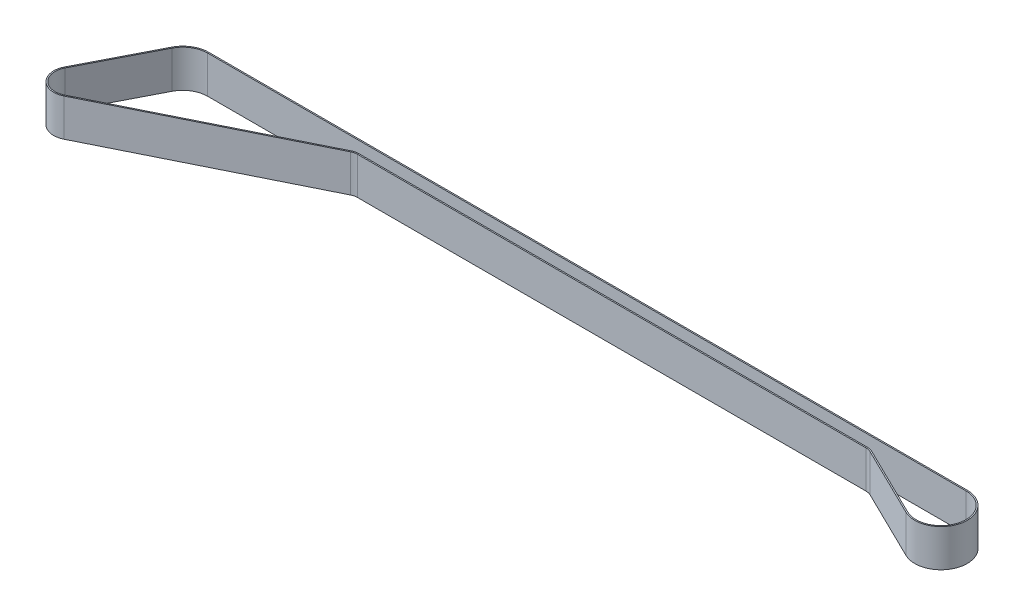
ISO-10303-21;
HEADER;
FILE_DESCRIPTION(('STEP AP214'),'2;1');
FILE_NAME('part.step','',(''),(''),'','','');
FILE_SCHEMA(('AUTOMOTIVE_DESIGN { 1 0 10303 214 1 1 1 1 }'));
ENDSEC;
DATA;
#1=APPLICATION_CONTEXT('core data for automotive mechanical design processes');
#2=APPLICATION_PROTOCOL_DEFINITION('international standard','automotive_design',2000,#1);
#3=PRODUCT_CONTEXT('',#1,'mechanical');
#4=PRODUCT('Part','Part','',(#3));
#5=PRODUCT_RELATED_PRODUCT_CATEGORY('part','',(#4));
#6=PRODUCT_DEFINITION_FORMATION('','',#4);
#7=PRODUCT_DEFINITION_CONTEXT('part definition',#1,'design');
#8=PRODUCT_DEFINITION('design','',#6,#7);
#9=PRODUCT_DEFINITION_SHAPE('','',#8);
#10=(LENGTH_UNIT() NAMED_UNIT(*) SI_UNIT(.MILLI.,.METRE.));
#11=(NAMED_UNIT(*) PLANE_ANGLE_UNIT() SI_UNIT($,.RADIAN.));
#12=(NAMED_UNIT(*) SI_UNIT($,.STERADIAN.) SOLID_ANGLE_UNIT());
#13=UNCERTAINTY_MEASURE_WITH_UNIT(LENGTH_MEASURE(1.E-05),#10,'distance_accuracy_value','');
#14=(GEOMETRIC_REPRESENTATION_CONTEXT(3) GLOBAL_UNCERTAINTY_ASSIGNED_CONTEXT((#13)) GLOBAL_UNIT_ASSIGNED_CONTEXT((#10,
#11,#12)) REPRESENTATION_CONTEXT('',''));
#15=CARTESIAN_POINT('',(0.,0.,0.));
#16=DIRECTION('',(0.,0.,1.));
#17=DIRECTION('',(1.,0.,0.));
#18=AXIS2_PLACEMENT_3D('',#15,#16,#17);
#19=CARTESIAN_POINT('',(-0.00171199897258548,15.,508.143236060332));
#20=DIRECTION('',(-3.36912675616625E-06,0.,0.999999999994325));
#21=DIRECTION('',(0.999999999994325,0.,3.36912675616625E-06));
#22=AXIS2_PLACEMENT_3D('',#19,#20,#21);
#23=PLANE('',#22);
#24=DIRECTION('',(-0.999999999994325,0.,-3.36912675616625E-06));
#25=VECTOR('',#24,1.);
#26=CARTESIAN_POINT('',(-0.00171199897258548,0.,508.143236060332));
#27=LINE('',#26,#25);
#28=CARTESIAN_POINT('',(1172.77740877326,0.,508.147187301847));
#29=VERTEX_POINT('',#28);
#30=CARTESIAN_POINT('',(868.796253252399,0.,508.146163150803));
#31=VERTEX_POINT('',#30);
#32=EDGE_CURVE('E239',#29,#31,#27,.T.);
#33=ORIENTED_EDGE('',*,*,#32,.T.);
#34=CARTESIAN_POINT('',(868.796253252399,15.,508.146163150817));
#35=DIRECTION('',(0.,-1.,0.));
#36=VECTOR('',#35,1.);
#37=LINE('',#34,#36);
#38=CARTESIAN_POINT('',(868.796253252399,15.,508.146163150803));
#39=VERTEX_POINT('',#38);
#40=EDGE_CURVE('E11',#39,#31,#37,.T.);
#41=ORIENTED_EDGE('',*,*,#40,.F.);
#42=DIRECTION('',(-0.999999999994325,0.,-3.36912675616625E-06));
#43=VECTOR('',#42,1.);
#44=CARTESIAN_POINT('',(-0.00171199897258548,15.,508.143236060332));
#45=LINE('',#44,#43);
#46=CARTESIAN_POINT('',(1172.77740877326,15.,508.147187301847));
#47=VERTEX_POINT('',#46);
#48=EDGE_CURVE('E397',#47,#39,#45,.T.);
#49=ORIENTED_EDGE('',*,*,#48,.F.);
#50=DIRECTION('',(0.,-1.,0.));
#51=VECTOR('',#50,1.);
#52=CARTESIAN_POINT('',(1172.77740877326,15.,508.147187301847));
#53=LINE('',#52,#51);
#54=EDGE_CURVE('E268',#47,#29,#53,.T.);
#55=ORIENTED_EDGE('',*,*,#54,.T.);
#56=EDGE_LOOP('',(#33,#41,#49,#55));
#57=FACE_BOUND('',#56,.T.);
#58=ADVANCED_FACE('F40',(#57),#23,.F.);
#59=CARTESIAN_POINT('',(868.796235564483,15.,518.646163150537));
#60=DIRECTION('',(0.,-1.,0.));
#61=DIRECTION('',(0.,0.,-1.));
#62=AXIS2_PLACEMENT_3D('',#59,#60,#61);
#63=CYLINDRICAL_SURFACE('',#62,10.4999999997344);
#64=CARTESIAN_POINT('',(868.796235564483,0.,518.646163150537));
#65=DIRECTION('',(0.,1.,0.));
#66=DIRECTION('',(0.,0.,1.));
#67=AXIS2_PLACEMENT_3D('',#64,#65,#66);
#68=CIRCLE('',#67,10.4999999997344);
#69=CARTESIAN_POINT('',(859.456696896738,0.,513.847932490375));
#70=VERTEX_POINT('',#69);
#71=EDGE_CURVE('E242',#31,#70,#68,.T.);
#72=ORIENTED_EDGE('',*,*,#71,.T.);
#73=DIRECTION('',(0.,-1.,0.));
#74=VECTOR('',#73,1.);
#75=CARTESIAN_POINT('',(859.456696896738,15.,513.847932490375));
#76=LINE('',#75,#74);
#77=CARTESIAN_POINT('',(859.456696896738,15.,513.847932490375));
#78=VERTEX_POINT('',#77);
#79=EDGE_CURVE('E52',#78,#70,#76,.T.);
#80=ORIENTED_EDGE('',*,*,#79,.F.);
#81=CARTESIAN_POINT('',(868.796235564483,15.,518.646163150537));
#82=DIRECTION('',(0.,1.,0.));
#83=DIRECTION('',(0.,0.,1.));
#84=AXIS2_PLACEMENT_3D('',#81,#82,#83);
#85=CIRCLE('',#84,10.4999999997344);
#86=EDGE_CURVE('E399',#39,#78,#85,.T.);
#87=ORIENTED_EDGE('',*,*,#86,.F.);
#88=ORIENTED_EDGE('',*,*,#40,.T.);
#89=EDGE_LOOP('',(#72,#80,#87,#88));
#90=FACE_BOUND('',#89,.T.);
#91=ADVANCED_FACE('F310',(#90),#63,.T.);
#92=CARTESIAN_POINT('',(888.843679737072,15.,456.647501330527));
#93=DIRECTION('',(-0.889479873141072,0.,-0.456974348598412));
#94=DIRECTION('',(-0.456974348598412,0.,0.889479873141072));
#95=AXIS2_PLACEMENT_3D('',#92,#93,#94);
#96=PLANE('',#95);
#97=DIRECTION('',(0.456974348598412,0.,-0.889479873141072));
#98=VECTOR('',#97,1.);
#99=CARTESIAN_POINT('',(888.843679737072,0.,456.647501330527));
#100=LINE('',#99,#98);
#101=CARTESIAN_POINT('',(844.881005563608,0.,542.218855536056));
#102=VERTEX_POINT('',#101);
#103=EDGE_CURVE('E247',#102,#70,#100,.T.);
#104=ORIENTED_EDGE('',*,*,#103,.F.);
#105=DIRECTION('',(0.,-1.,0.));
#106=VECTOR('',#105,1.);
#107=CARTESIAN_POINT('',(844.881005563608,15.,542.218855536056));
#108=LINE('',#107,#106);
#109=CARTESIAN_POINT('',(844.881005563608,15.,542.218855536056));
#110=VERTEX_POINT('',#109);
#111=EDGE_CURVE('E279',#110,#102,#108,.T.);
#112=ORIENTED_EDGE('',*,*,#111,.F.);
#113=DIRECTION('',(0.456974348598412,0.,-0.889479873141072));
#114=VECTOR('',#113,1.);
#115=CARTESIAN_POINT('',(888.843679737072,15.,456.647501330527));
#116=LINE('',#115,#114);
#117=EDGE_CURVE('E403',#110,#78,#116,.T.);
#118=ORIENTED_EDGE('',*,*,#117,.T.);
#119=ORIENTED_EDGE('',*,*,#79,.T.);
#120=EDGE_LOOP('',(#104,#112,#118,#119));
#121=FACE_BOUND('',#120,.T.);
#122=ADVANCED_FACE('F319',(#121),#96,.T.);
#123=CARTESIAN_POINT('',(851.552104612212,15.,545.646163150568));
#124=DIRECTION('',(0.,-1.,0.));
#125=DIRECTION('',(0.,0.,-1.));
#126=AXIS2_PLACEMENT_3D('',#123,#124,#125);
#127=CYLINDRICAL_SURFACE('',#126,7.50000000005222);
#128=CARTESIAN_POINT('',(851.552104612212,0.,545.646163150568));
#129=DIRECTION('',(0.,1.,0.));
#130=DIRECTION('',(0.,0.,1.));
#131=AXIS2_PLACEMENT_3D('',#128,#129,#130);
#132=CIRCLE('',#131,7.50000000005222);
#133=CARTESIAN_POINT('',(854.882744904987,0.,552.366046724033));
#134=VERTEX_POINT('',#133);
#135=EDGE_CURVE('E252',#102,#134,#132,.T.);
#136=ORIENTED_EDGE('',*,*,#135,.T.);
#137=DIRECTION('',(0.,-1.,0.));
#138=VECTOR('',#137,1.);
#139=CARTESIAN_POINT('',(854.882744904987,15.,552.366046724033));
#140=LINE('',#139,#138);
#141=CARTESIAN_POINT('',(854.882744904987,15.,552.366046724033));
#142=VERTEX_POINT('',#141);
#143=EDGE_CURVE('E276',#142,#134,#140,.T.);
#144=ORIENTED_EDGE('',*,*,#143,.F.);
#145=CARTESIAN_POINT('',(851.552104612212,15.,545.646163150568));
#146=DIRECTION('',(0.,1.,0.));
#147=DIRECTION('',(0.,0.,1.));
#148=AXIS2_PLACEMENT_3D('',#145,#146,#147);
#149=CIRCLE('',#148,7.50000000005222);
#150=EDGE_CURVE('E408',#110,#142,#149,.T.);
#151=ORIENTED_EDGE('',*,*,#150,.F.);
#152=ORIENTED_EDGE('',*,*,#111,.T.);
#153=EDGE_LOOP('',(#136,#144,#151,#152));
#154=FACE_BOUND('',#153,.T.);
#155=ADVANCED_FACE('F440',(#154),#127,.T.);
#156=CARTESIAN_POINT('',(388.375895029462,15.,783.585307305601));
#157=DIRECTION('',(-0.44408537236688,0.,-0.895984476455797));
#158=DIRECTION('',(-0.895984476455797,0.,0.44408537236688));
#159=AXIS2_PLACEMENT_3D('',#156,#157,#158);
#160=PLANE('',#159);
#161=DIRECTION('',(0.895984476455797,0.,-0.44408537236688));
#162=VECTOR('',#161,1.);
#163=CARTESIAN_POINT('',(388.375895029462,0.,783.585307305601));
#164=LINE('',#163,#162);
#165=CARTESIAN_POINT('',(931.727868646389,0.,514.278561630241));
#166=VERTEX_POINT('',#165);
#167=EDGE_CURVE('E254',#134,#166,#164,.T.);
#168=ORIENTED_EDGE('',*,*,#167,.T.);
#169=DIRECTION('',(0.,-1.,0.));
#170=VECTOR('',#169,1.);
#171=CARTESIAN_POINT('',(931.727868646389,15.,514.278561630241));
#172=LINE('',#171,#170);
#173=CARTESIAN_POINT('',(931.727868646389,15.,514.278561630241));
#174=VERTEX_POINT('',#173);
#175=EDGE_CURVE('E274',#174,#166,#172,.T.);
#176=ORIENTED_EDGE('',*,*,#175,.F.);
#177=DIRECTION('',(0.895984476455797,0.,-0.44408537236688));
#178=VECTOR('',#177,1.);
#179=CARTESIAN_POINT('',(388.375895029462,15.,783.585307305601));
#180=LINE('',#179,#178);
#181=EDGE_CURVE('E410',#142,#174,#180,.T.);
#182=ORIENTED_EDGE('',*,*,#181,.F.);
#183=ORIENTED_EDGE('',*,*,#143,.T.);
#184=EDGE_LOOP('',(#168,#176,#182,#183));
#185=FACE_BOUND('',#184,.T.);
#186=ADVANCED_FACE('F437',(#185),#160,.F.);
#187=CARTESIAN_POINT('',(933.948295508223,15.,518.75848401252));
#188=DIRECTION('',(0.,-1.,0.));
#189=DIRECTION('',(0.,0.,-1.));
#190=AXIS2_PLACEMENT_3D('',#187,#188,#189);
#191=CYLINDRICAL_SURFACE('',#190,5.00000000000018);
#192=CARTESIAN_POINT('',(933.948295508223,0.,518.75848401252));
#193=DIRECTION('',(0.,1.,0.));
#194=DIRECTION('',(0.,0.,1.));
#195=AXIS2_PLACEMENT_3D('',#192,#193,#194);
#196=CIRCLE('',#195,5.00000000000018);
#197=CARTESIAN_POINT('',(933.948295508223,0.,513.75848401252));
#198=VERTEX_POINT('',#197);
#199=EDGE_CURVE('E257',#198,#166,#196,.T.);
#200=ORIENTED_EDGE('',*,*,#199,.F.);
#201=DIRECTION('',(0.,-1.,0.));
#202=VECTOR('',#201,1.);
#203=CARTESIAN_POINT('',(933.948295508223,15.,513.75848401252));
#204=LINE('',#203,#202);
#205=CARTESIAN_POINT('',(933.948295508223,15.,513.75848401252));
#206=VERTEX_POINT('',#205);
#207=EDGE_CURVE('E272',#206,#198,#204,.T.);
#208=ORIENTED_EDGE('',*,*,#207,.F.);
#209=CARTESIAN_POINT('',(933.948295508223,15.,518.75848401252));
#210=DIRECTION('',(0.,1.,0.));
#211=DIRECTION('',(0.,0.,1.));
#212=AXIS2_PLACEMENT_3D('',#209,#210,#211);
#213=CIRCLE('',#212,5.00000000000018);
#214=EDGE_CURVE('E412',#206,#174,#213,.T.);
#215=ORIENTED_EDGE('',*,*,#214,.T.);
#216=ORIENTED_EDGE('',*,*,#175,.T.);
#217=EDGE_LOOP('',(#200,#208,#215,#216));
#218=FACE_BOUND('',#217,.T.);
#219=ADVANCED_FACE('F434',(#218),#191,.F.);
#220=CARTESIAN_POINT('',(0.,15.,513.75848401252));
#221=DIRECTION('',(0.,0.,1.));
#222=DIRECTION('',(1.,0.,0.));
#223=AXIS2_PLACEMENT_3D('',#220,#221,#222);
#224=PLANE('',#223);
#225=DIRECTION('',(-1.,0.,0.));
#226=VECTOR('',#225,1.);
#227=CARTESIAN_POINT('',(0.,0.,513.75848401252));
#228=LINE('',#227,#226);
#229=CARTESIAN_POINT('',(1137.77740876809,0.,513.75848401252));
#230=VERTEX_POINT('',#229);
#231=EDGE_CURVE('E260',#230,#198,#228,.T.);
#232=ORIENTED_EDGE('',*,*,#231,.F.);
#233=DIRECTION('',(0.,-1.,0.));
#234=VECTOR('',#233,1.);
#235=CARTESIAN_POINT('',(1137.77740876809,15.,513.75848401252));
#236=LINE('',#235,#234);
#237=CARTESIAN_POINT('',(1137.77740876809,15.,513.75848401252));
#238=VERTEX_POINT('',#237);
#239=EDGE_CURVE('E198',#238,#230,#236,.T.);
#240=ORIENTED_EDGE('',*,*,#239,.F.);
#241=DIRECTION('',(-1.,0.,0.));
#242=VECTOR('',#241,1.);
#243=CARTESIAN_POINT('',(0.,15.,513.75848401252));
#244=LINE('',#243,#242);
#245=EDGE_CURVE('E205',#238,#206,#244,.T.);
#246=ORIENTED_EDGE('',*,*,#245,.T.);
#247=ORIENTED_EDGE('',*,*,#207,.T.);
#248=EDGE_LOOP('',(#232,#240,#246,#247));
#249=FACE_BOUND('',#248,.T.);
#250=ADVANCED_FACE('F416',(#249),#224,.T.);
#251=CARTESIAN_POINT('',(1137.77740876809,15.,518.75848401252));
#252=DIRECTION('',(0.,-1.,0.));
#253=DIRECTION('',(0.,0.,-1.));
#254=AXIS2_PLACEMENT_3D('',#251,#252,#253);
#255=CYLINDRICAL_SURFACE('',#254,5.00000000000006);
#256=CARTESIAN_POINT('',(1137.77740876809,0.,518.75848401252));
#257=DIRECTION('',(0.,1.,0.));
#258=DIRECTION('',(0.,0.,1.));
#259=AXIS2_PLACEMENT_3D('',#256,#257,#258);
#260=CIRCLE('',#259,5.00000000000006);
#261=CARTESIAN_POINT('',(1139.97741675187,0.,514.268499060287));
#262=VERTEX_POINT('',#261);
#263=EDGE_CURVE('E193',#262,#230,#260,.T.);
#264=ORIENTED_EDGE('',*,*,#263,.F.);
#265=DIRECTION('',(0.,-1.,0.));
#266=VECTOR('',#265,1.);
#267=CARTESIAN_POINT('',(1139.97741675187,15.,514.268499060287));
#268=LINE('',#267,#266);
#269=CARTESIAN_POINT('',(1139.97741675187,15.,514.268499060287));
#270=VERTEX_POINT('',#269);
#271=EDGE_CURVE('E188',#270,#262,#268,.T.);
#272=ORIENTED_EDGE('',*,*,#271,.F.);
#273=CARTESIAN_POINT('',(1137.77740876809,15.,518.75848401252));
#274=DIRECTION('',(0.,1.,0.));
#275=DIRECTION('',(0.,0.,1.));
#276=AXIS2_PLACEMENT_3D('',#273,#274,#275);
#277=CIRCLE('',#276,5.00000000000006);
#278=EDGE_CURVE('E191',#270,#238,#277,.T.);
#279=ORIENTED_EDGE('',*,*,#278,.T.);
#280=ORIENTED_EDGE('',*,*,#239,.T.);
#281=EDGE_LOOP('',(#264,#272,#279,#280));
#282=FACE_BOUND('',#281,.T.);
#283=ADVANCED_FACE('F190',(#282),#255,.F.);
#284=CARTESIAN_POINT('',(17.50340396747,15.,-35.7226069205508));
#285=DIRECTION('',(-0.440001596756898,0.,0.897996990446727));
#286=DIRECTION('',(0.897996990446727,0.,0.440001596756898));
#287=AXIS2_PLACEMENT_3D('',#284,#285,#286);
#288=PLANE('',#287);
#289=DIRECTION('',(-0.897996990446727,0.,-0.440001596756898));
#290=VECTOR('',#289,1.);
#291=CARTESIAN_POINT('',(17.50340396747,0.,-35.7226069205508));
#292=LINE('',#291,#290);
#293=CARTESIAN_POINT('',(1168.15739200731,0.,528.076155701537));
#294=VERTEX_POINT('',#293);
#295=EDGE_CURVE('E264',#294,#262,#292,.T.);
#296=ORIENTED_EDGE('',*,*,#295,.F.);
#297=DIRECTION('',(0.,-1.,0.));
#298=VECTOR('',#297,1.);
#299=CARTESIAN_POINT('',(1168.15739200731,15.,528.076155701537));
#300=LINE('',#299,#298);
#301=CARTESIAN_POINT('',(1168.15739200731,15.,528.076155701537));
#302=VERTEX_POINT('',#301);
#303=EDGE_CURVE('E124',#302,#294,#300,.T.);
#304=ORIENTED_EDGE('',*,*,#303,.F.);
#305=DIRECTION('',(-0.897996990446727,0.,-0.440001596756898));
#306=VECTOR('',#305,1.);
#307=CARTESIAN_POINT('',(17.50340396747,15.,-35.7226069205508));
#308=LINE('',#307,#306);
#309=EDGE_CURVE('E202',#302,#270,#308,.T.);
#310=ORIENTED_EDGE('',*,*,#309,.T.);
#311=ORIENTED_EDGE('',*,*,#271,.T.);
#312=EDGE_LOOP('',(#296,#304,#310,#311));
#313=FACE_BOUND('',#312,.T.);
#314=ADVANCED_FACE('F207',(#313),#288,.T.);
#315=CARTESIAN_POINT('',(868.796235564483,15.,518.646163150537));
#316=DIRECTION('',(0.,-1.,0.));
#317=DIRECTION('',(0.,0.,-1.));
#318=AXIS2_PLACEMENT_3D('',#315,#316,#317);
#319=CYLINDRICAL_SURFACE('',#318,9.99999999972857);
#320=CARTESIAN_POINT('',(868.796235564483,0.,518.646163150537));
#321=DIRECTION('',(0.,1.,0.));
#322=DIRECTION('',(0.,0.,1.));
#323=AXIS2_PLACEMENT_3D('',#320,#321,#322);
#324=CIRCLE('',#323,9.99999999972857);
#325=CARTESIAN_POINT('',(868.79623219543,0.,508.646163150558));
#326=VERTEX_POINT('',#325);
#327=CARTESIAN_POINT('',(859.901436833315,0.,514.076419664675));
#328=VERTEX_POINT('',#327);
#329=EDGE_CURVE('E213',#326,#328,#324,.T.);
#330=ORIENTED_EDGE('',*,*,#329,.F.);
#331=DIRECTION('',(0.,-1.,0.));
#332=VECTOR('',#331,1.);
#333=CARTESIAN_POINT('',(868.79623219543,15.,508.646163150558));
#334=LINE('',#333,#332);
#335=CARTESIAN_POINT('',(868.79623219543,15.,508.646163150558));
#336=VERTEX_POINT('',#335);
#337=EDGE_CURVE('E135',#336,#326,#334,.T.);
#338=ORIENTED_EDGE('',*,*,#337,.F.);
#339=CARTESIAN_POINT('',(868.796235564483,15.,518.646163150537));
#340=DIRECTION('',(0.,1.,0.));
#341=DIRECTION('',(0.,0.,1.));
#342=AXIS2_PLACEMENT_3D('',#339,#340,#341);
#343=CIRCLE('',#342,9.99999999972857);
#344=CARTESIAN_POINT('',(859.901436833315,15.,514.076419664675));
#345=VERTEX_POINT('',#344);
#346=EDGE_CURVE('E267',#336,#345,#343,.T.);
#347=ORIENTED_EDGE('',*,*,#346,.T.);
#348=DIRECTION('',(0.,-1.,0.));
#349=VECTOR('',#348,1.);
#350=CARTESIAN_POINT('',(859.901436833315,15.,514.076419664675));
#351=LINE('',#350,#349);
#352=EDGE_CURVE('E209',#345,#328,#351,.T.);
#353=ORIENTED_EDGE('',*,*,#352,.T.);
#354=EDGE_LOOP('',(#330,#338,#347,#353));
#355=FACE_BOUND('',#354,.T.);
#356=ADVANCED_FACE('F42',(#355),#319,.F.);
#357=CARTESIAN_POINT('',(-0.00342729103248066,15.,508.640309054395));
#358=DIRECTION('',(-6.73814279244694E-06,0.,0.999999999977299));
#359=DIRECTION('',(0.999999999977299,0.,6.73814279244694E-06));
#360=AXIS2_PLACEMENT_3D('',#357,#358,#359);
#361=PLANE('',#360);
#362=DIRECTION('',(-0.999999999977299,0.,-6.73814279244694E-06));
#363=VECTOR('',#362,1.);
#364=CARTESIAN_POINT('',(-0.00342729103248066,0.,508.640309054395));
#365=LINE('',#364,#363);
#366=CARTESIAN_POINT('',(1172.7810511332,0.,508.648211443675));
#367=VERTEX_POINT('',#366);
#368=EDGE_CURVE('E216',#367,#326,#365,.T.);
#369=ORIENTED_EDGE('',*,*,#368,.F.);
#370=DIRECTION('',(0.,-1.,0.));
#371=VECTOR('',#370,1.);
#372=CARTESIAN_POINT('',(1172.7810511332,15.,508.648211443675));
#373=LINE('',#372,#371);
#374=CARTESIAN_POINT('',(1172.7810511332,15.,508.648211443675));
#375=VERTEX_POINT('',#374);
#376=EDGE_CURVE('E301',#375,#367,#373,.T.);
#377=ORIENTED_EDGE('',*,*,#376,.F.);
#378=DIRECTION('',(-0.999999999977299,0.,-6.73814279244694E-06));
#379=VECTOR('',#378,1.);
#380=CARTESIAN_POINT('',(-0.00342729103248066,15.,508.640309054395));
#381=LINE('',#380,#379);
#382=EDGE_CURVE('E378',#375,#336,#381,.T.);
#383=ORIENTED_EDGE('',*,*,#382,.T.);
#384=ORIENTED_EDGE('',*,*,#337,.T.);
#385=EDGE_LOOP('',(#369,#377,#383,#384));
#386=FACE_BOUND('',#385,.T.);
#387=ADVANCED_FACE('F356',(#386),#361,.T.);
#388=CARTESIAN_POINT('',(1172.77740876809,15.,518.648211397551));
#389=DIRECTION('',(0.,-1.,0.));
#390=DIRECTION('',(0.,0.,-1.));
#391=AXIS2_PLACEMENT_3D('',#388,#389,#390);
#392=CYLINDRICAL_SURFACE('',#391,10.0000000000061);
#393=CARTESIAN_POINT('',(1172.77740876809,0.,518.648211397551));
#394=DIRECTION('',(0.,1.,0.));
#395=DIRECTION('',(0.,0.,1.));
#396=AXIS2_PLACEMENT_3D('',#393,#394,#395);
#397=CIRCLE('',#396,10.0000000000061);
#398=CARTESIAN_POINT('',(1168.37712964078,0.,527.628052353931));
#399=VERTEX_POINT('',#398);
#400=EDGE_CURVE('E219',#399,#367,#397,.T.);
#401=ORIENTED_EDGE('',*,*,#400,.F.);
#402=DIRECTION('',(0.,-1.,0.));
#403=VECTOR('',#402,1.);
#404=CARTESIAN_POINT('',(1168.37712964078,15.,527.628052353931));
#405=LINE('',#404,#403);
#406=CARTESIAN_POINT('',(1168.37712964078,15.,527.628052353931));
#407=VERTEX_POINT('',#406);
#408=EDGE_CURVE('E299',#407,#399,#405,.T.);
#409=ORIENTED_EDGE('',*,*,#408,.F.);
#410=CARTESIAN_POINT('',(1172.77740876809,15.,518.648211397551));
#411=DIRECTION('',(0.,1.,0.));
#412=DIRECTION('',(0.,0.,1.));
#413=AXIS2_PLACEMENT_3D('',#410,#411,#412);
#414=CIRCLE('',#413,10.0000000000061);
#415=EDGE_CURVE('E375',#407,#375,#414,.T.);
#416=ORIENTED_EDGE('',*,*,#415,.T.);
#417=ORIENTED_EDGE('',*,*,#376,.T.);
#418=EDGE_LOOP('',(#401,#409,#416,#417));
#419=FACE_BOUND('',#418,.T.);
#420=ADVANCED_FACE('F353',(#419),#392,.F.);
#421=CARTESIAN_POINT('',(17.7405834494117,15.,-36.2039800749117));
#422=DIRECTION('',(-0.440027912730566,0.,0.897984095637546));
#423=DIRECTION('',(0.897984095637546,0.,0.440027912730566));
#424=AXIS2_PLACEMENT_3D('',#421,#422,#423);
#425=PLANE('',#424);
#426=DIRECTION('',(-0.897984095637546,0.,-0.440027912730566));
#427=VECTOR('',#426,1.);
#428=CARTESIAN_POINT('',(17.7405834494117,0.,-36.2039800749117));
#429=LINE('',#428,#427);
#430=CARTESIAN_POINT('',(1140.1975622881,0.,513.819571486523));
#431=VERTEX_POINT('',#430);
#432=EDGE_CURVE('E222',#399,#431,#429,.T.);
#433=ORIENTED_EDGE('',*,*,#432,.T.);
#434=DIRECTION('',(0.,-1.,0.));
#435=VECTOR('',#434,1.);
#436=CARTESIAN_POINT('',(1140.1975622881,15.,513.819571486523));
#437=LINE('',#436,#435);
#438=CARTESIAN_POINT('',(1140.1975622881,15.,513.819571486523));
#439=VERTEX_POINT('',#438);
#440=EDGE_CURVE('E296',#439,#431,#437,.T.);
#441=ORIENTED_EDGE('',*,*,#440,.F.);
#442=DIRECTION('',(-0.897984095637546,0.,-0.440027912730566));
#443=VECTOR('',#442,1.);
#444=CARTESIAN_POINT('',(17.7405834494117,15.,-36.2039800749117));
#445=LINE('',#444,#443);
#446=EDGE_CURVE('E377',#407,#439,#445,.T.);
#447=ORIENTED_EDGE('',*,*,#446,.F.);
#448=ORIENTED_EDGE('',*,*,#408,.T.);
#449=EDGE_LOOP('',(#433,#441,#447,#448));
#450=FACE_BOUND('',#449,.T.);
#451=ADVANCED_FACE('F349',(#450),#425,.F.);
#452=CARTESIAN_POINT('',(1137.77740876809,15.,518.75848401253));
#453=DIRECTION('',(0.,-1.,0.));
#454=DIRECTION('',(0.,0.,-1.));
#455=AXIS2_PLACEMENT_3D('',#452,#453,#454);
#456=CYLINDRICAL_SURFACE('',#455,5.50000000000005);
#457=CARTESIAN_POINT('',(1137.77740876809,0.,518.75848401253));
#458=DIRECTION('',(0.,1.,0.));
#459=DIRECTION('',(0.,0.,1.));
#460=AXIS2_PLACEMENT_3D('',#457,#458,#459);
#461=CIRCLE('',#460,5.50000000000005);
#462=CARTESIAN_POINT('',(1137.77740876809,0.,513.258484012529));
#463=VERTEX_POINT('',#462);
#464=EDGE_CURVE('E224',#431,#463,#461,.T.);
#465=ORIENTED_EDGE('',*,*,#464,.T.);
#466=DIRECTION('',(0.,-1.,0.));
#467=VECTOR('',#466,1.);
#468=CARTESIAN_POINT('',(1137.77740876809,15.,513.258484012529));
#469=LINE('',#468,#467);
#470=CARTESIAN_POINT('',(1137.77740876809,15.,513.258484012529));
#471=VERTEX_POINT('',#470);
#472=EDGE_CURVE('E293',#471,#463,#469,.T.);
#473=ORIENTED_EDGE('',*,*,#472,.F.);
#474=CARTESIAN_POINT('',(1137.77740876809,15.,518.75848401253));
#475=DIRECTION('',(0.,1.,0.));
#476=DIRECTION('',(0.,0.,1.));
#477=AXIS2_PLACEMENT_3D('',#474,#475,#476);
#478=CIRCLE('',#477,5.50000000000005);
#479=EDGE_CURVE('E380',#439,#471,#478,.T.);
#480=ORIENTED_EDGE('',*,*,#479,.F.);
#481=ORIENTED_EDGE('',*,*,#440,.T.);
#482=EDGE_LOOP('',(#465,#473,#480,#481));
#483=FACE_BOUND('',#482,.T.);
#484=ADVANCED_FACE('F345',(#483),#456,.T.);
#485=CARTESIAN_POINT('',(0.,15.,513.258484012529));
#486=DIRECTION('',(0.,0.,1.));
#487=DIRECTION('',(1.,0.,0.));
#488=AXIS2_PLACEMENT_3D('',#485,#486,#487);
#489=PLANE('',#488);
#490=DIRECTION('',(-1.,0.,0.));
#491=VECTOR('',#490,1.);
#492=CARTESIAN_POINT('',(0.,0.,513.258484012529));
#493=LINE('',#492,#491);
#494=CARTESIAN_POINT('',(933.948295508224,0.,513.258484012529));
#495=VERTEX_POINT('',#494);
#496=EDGE_CURVE('E226',#463,#495,#493,.T.);
#497=ORIENTED_EDGE('',*,*,#496,.T.);
#498=DIRECTION('',(0.,-1.,0.));
#499=VECTOR('',#498,1.);
#500=CARTESIAN_POINT('',(933.948295508224,15.,513.258484012529));
#501=LINE('',#500,#499);
#502=CARTESIAN_POINT('',(933.948295508224,15.,513.258484012529));
#503=VERTEX_POINT('',#502);
#504=EDGE_CURVE('E290',#503,#495,#501,.T.);
#505=ORIENTED_EDGE('',*,*,#504,.F.);
#506=DIRECTION('',(-1.,0.,0.));
#507=VECTOR('',#506,1.);
#508=CARTESIAN_POINT('',(0.,15.,513.258484012529));
#509=LINE('',#508,#507);
#510=EDGE_CURVE('E386',#471,#503,#509,.T.);
#511=ORIENTED_EDGE('',*,*,#510,.F.);
#512=ORIENTED_EDGE('',*,*,#472,.T.);
#513=EDGE_LOOP('',(#497,#505,#511,#512));
#514=FACE_BOUND('',#513,.T.);
#515=ADVANCED_FACE('F341',(#514),#489,.F.);
#516=CARTESIAN_POINT('',(933.948295508223,15.,518.75848401252));
#517=DIRECTION('',(0.,-1.,0.));
#518=DIRECTION('',(0.,0.,-1.));
#519=AXIS2_PLACEMENT_3D('',#516,#517,#518);
#520=CYLINDRICAL_SURFACE('',#519,5.4999999999908);
#521=CARTESIAN_POINT('',(933.948295508223,0.,518.75848401252));
#522=DIRECTION('',(0.,1.,0.));
#523=DIRECTION('',(0.,0.,1.));
#524=AXIS2_PLACEMENT_3D('',#521,#522,#523);
#525=CIRCLE('',#524,5.4999999999908);
#526=CARTESIAN_POINT('',(931.505825960217,0.,513.830569392018));
#527=VERTEX_POINT('',#526);
#528=EDGE_CURVE('E228',#495,#527,#525,.T.);
#529=ORIENTED_EDGE('',*,*,#528,.T.);
#530=DIRECTION('',(0.,-1.,0.));
#531=VECTOR('',#530,1.);
#532=CARTESIAN_POINT('',(931.505825960217,15.,513.830569392018));
#533=LINE('',#532,#531);
#534=CARTESIAN_POINT('',(931.505825960217,15.,513.830569392018));
#535=VERTEX_POINT('',#534);
#536=EDGE_CURVE('E287',#535,#527,#533,.T.);
#537=ORIENTED_EDGE('',*,*,#536,.F.);
#538=CARTESIAN_POINT('',(933.948295508223,15.,518.75848401252));
#539=DIRECTION('',(0.,1.,0.));
#540=DIRECTION('',(0.,0.,1.));
#541=AXIS2_PLACEMENT_3D('',#538,#539,#540);
#542=CIRCLE('',#541,5.4999999999908);
#543=EDGE_CURVE('E388',#503,#535,#542,.T.);
#544=ORIENTED_EDGE('',*,*,#543,.F.);
#545=ORIENTED_EDGE('',*,*,#504,.T.);
#546=EDGE_LOOP('',(#529,#537,#544,#545));
#547=FACE_BOUND('',#546,.T.);
#548=ADVANCED_FACE('F337',(#547),#520,.T.);
#549=CARTESIAN_POINT('',(388.153852341816,15.,783.137315067166));
#550=DIRECTION('',(0.444085372365632,0.,0.895984476456416));
#551=DIRECTION('',(0.895984476456416,0.,-0.444085372365632));
#552=AXIS2_PLACEMENT_3D('',#549,#550,#551);
#553=PLANE('',#552);
#554=DIRECTION('',(-0.895984476456416,0.,0.444085372365632));
#555=VECTOR('',#554,1.);
#556=CARTESIAN_POINT('',(388.153852341816,0.,783.137315067166));
#557=LINE('',#556,#555);
#558=CARTESIAN_POINT('',(854.660702218746,0.,551.918054485711));
#559=VERTEX_POINT('',#558);
#560=EDGE_CURVE('E230',#527,#559,#557,.T.);
#561=ORIENTED_EDGE('',*,*,#560,.T.);
#562=DIRECTION('',(0.,-1.,0.));
#563=VECTOR('',#562,1.);
#564=CARTESIAN_POINT('',(854.660702218746,15.,551.918054485711));
#565=LINE('',#564,#563);
#566=CARTESIAN_POINT('',(854.660702218746,15.,551.918054485711));
#567=VERTEX_POINT('',#566);
#568=EDGE_CURVE('E285',#567,#559,#565,.T.);
#569=ORIENTED_EDGE('',*,*,#568,.F.);
#570=DIRECTION('',(-0.895984476456416,0.,0.444085372365632));
#571=VECTOR('',#570,1.);
#572=CARTESIAN_POINT('',(388.153852341816,15.,783.137315067166));
#573=LINE('',#572,#571);
#574=EDGE_CURVE('E390',#535,#567,#573,.T.);
#575=ORIENTED_EDGE('',*,*,#574,.F.);
#576=ORIENTED_EDGE('',*,*,#536,.T.);
#577=EDGE_LOOP('',(#561,#569,#575,#576));
#578=FACE_BOUND('',#577,.T.);
#579=ADVANCED_FACE('F333',(#578),#553,.F.);
#580=CARTESIAN_POINT('',(851.552104612212,15.,545.646163150568));
#581=DIRECTION('',(0.,-1.,0.));
#582=DIRECTION('',(0.,0.,-1.));
#583=AXIS2_PLACEMENT_3D('',#580,#581,#582);
#584=CYLINDRICAL_SURFACE('',#583,6.99999999994214);
#585=CARTESIAN_POINT('',(851.552104612212,0.,545.646163150568));
#586=DIRECTION('',(0.,1.,0.));
#587=DIRECTION('',(0.,0.,1.));
#588=AXIS2_PLACEMENT_3D('',#585,#586,#587);
#589=CIRCLE('',#588,6.99999999994214);
#590=CARTESIAN_POINT('',(845.325745500266,0.,542.447342710426));
#591=VERTEX_POINT('',#590);
#592=EDGE_CURVE('E233',#591,#559,#589,.T.);
#593=ORIENTED_EDGE('',*,*,#592,.F.);
#594=DIRECTION('',(0.,-1.,0.));
#595=VECTOR('',#594,1.);
#596=CARTESIAN_POINT('',(845.325745500266,15.,542.447342710426));
#597=LINE('',#596,#595);
#598=CARTESIAN_POINT('',(845.325745500266,15.,542.447342710426));
#599=VERTEX_POINT('',#598);
#600=EDGE_CURVE('E283',#599,#591,#597,.T.);
#601=ORIENTED_EDGE('',*,*,#600,.F.);
#602=CARTESIAN_POINT('',(851.552104612212,15.,545.646163150568));
#603=DIRECTION('',(0.,1.,0.));
#604=DIRECTION('',(0.,0.,1.));
#605=AXIS2_PLACEMENT_3D('',#602,#603,#604);
#606=CIRCLE('',#605,6.99999999994214);
#607=EDGE_CURVE('E392',#599,#567,#606,.T.);
#608=ORIENTED_EDGE('',*,*,#607,.T.);
#609=ORIENTED_EDGE('',*,*,#568,.T.);
#610=EDGE_LOOP('',(#593,#601,#608,#609));
#611=FACE_BOUND('',#610,.T.);
#612=ADVANCED_FACE('F329',(#611),#584,.F.);
#613=CARTESIAN_POINT('',(889.288419674952,15.,456.875988501834));
#614=DIRECTION('',(-0.889479873142562,0.,-0.456974348595512));
#615=DIRECTION('',(-0.456974348595512,0.,0.889479873142562));
#616=AXIS2_PLACEMENT_3D('',#613,#614,#615);
#617=PLANE('',#616);
#618=DIRECTION('',(0.456974348595512,0.,-0.889479873142562));
#619=VECTOR('',#618,1.);
#620=CARTESIAN_POINT('',(889.288419674952,0.,456.875988501834));
#621=LINE('',#620,#619);
#622=EDGE_CURVE('E236',#591,#328,#621,.T.);
#623=ORIENTED_EDGE('',*,*,#622,.T.);
#624=ORIENTED_EDGE('',*,*,#352,.F.);
#625=DIRECTION('',(0.456974348595512,0.,-0.889479873142562));
#626=VECTOR('',#625,1.);
#627=CARTESIAN_POINT('',(889.288419674952,15.,456.875988501834));
#628=LINE('',#627,#626);
#629=EDGE_CURVE('E395',#599,#345,#628,.T.);
#630=ORIENTED_EDGE('',*,*,#629,.F.);
#631=ORIENTED_EDGE('',*,*,#600,.T.);
#632=EDGE_LOOP('',(#623,#624,#630,#631));
#633=FACE_BOUND('',#632,.T.);
#634=ADVANCED_FACE('F325',(#633),#617,.F.);
#635=CARTESIAN_POINT('',(1172.77740877326,15.,518.647187301847));
#636=DIRECTION('',(0.,-1.,0.));
#637=DIRECTION('',(0.,0.,-1.));
#638=AXIS2_PLACEMENT_3D('',#635,#636,#637);
#639=CYLINDRICAL_SURFACE('',#638,10.4999999999998);
#640=CARTESIAN_POINT('',(1172.77740877326,0.,518.647187301847));
#641=DIRECTION('',(0.,1.,0.));
#642=DIRECTION('',(0.,0.,1.));
#643=AXIS2_PLACEMENT_3D('',#640,#641,#642);
#644=CIRCLE('',#643,10.4999999999998);
#645=EDGE_CURVE('E127',#294,#29,#644,.T.);
#646=ORIENTED_EDGE('',*,*,#645,.T.);
#647=ORIENTED_EDGE('',*,*,#54,.F.);
#648=CARTESIAN_POINT('',(1172.77740877326,15.,518.647187301847));
#649=DIRECTION('',(0.,1.,0.));
#650=DIRECTION('',(0.,0.,1.));
#651=AXIS2_PLACEMENT_3D('',#648,#649,#650);
#652=CIRCLE('',#651,10.4999999999998);
#653=EDGE_CURVE('E60',#302,#47,#652,.T.);
#654=ORIENTED_EDGE('',*,*,#653,.F.);
#655=ORIENTED_EDGE('',*,*,#303,.T.);
#656=EDGE_LOOP('',(#646,#647,#654,#655));
#657=FACE_BOUND('',#656,.T.);
#658=ADVANCED_FACE('F328',(#657),#639,.T.);
#659=CARTESIAN_POINT('',(0.,15.,0.));
#660=DIRECTION('',(0.,1.,0.));
#661=DIRECTION('',(0.,0.,1.));
#662=AXIS2_PLACEMENT_3D('',#659,#660,#661);
#663=PLANE('',#662);
#664=ORIENTED_EDGE('',*,*,#346,.F.);
#665=ORIENTED_EDGE('',*,*,#382,.F.);
#666=ORIENTED_EDGE('',*,*,#415,.F.);
#667=ORIENTED_EDGE('',*,*,#446,.T.);
#668=ORIENTED_EDGE('',*,*,#479,.T.);
#669=ORIENTED_EDGE('',*,*,#510,.T.);
#670=ORIENTED_EDGE('',*,*,#543,.T.);
#671=ORIENTED_EDGE('',*,*,#574,.T.);
#672=ORIENTED_EDGE('',*,*,#607,.F.);
#673=ORIENTED_EDGE('',*,*,#629,.T.);
#674=EDGE_LOOP('',(#664,#665,#666,#667,#668,#669,#670,#671,#672,#673));
#675=FACE_BOUND('',#674,.T.);
#676=ORIENTED_EDGE('',*,*,#48,.T.);
#677=ORIENTED_EDGE('',*,*,#86,.T.);
#678=ORIENTED_EDGE('',*,*,#117,.F.);
#679=ORIENTED_EDGE('',*,*,#150,.T.);
#680=ORIENTED_EDGE('',*,*,#181,.T.);
#681=ORIENTED_EDGE('',*,*,#214,.F.);
#682=ORIENTED_EDGE('',*,*,#245,.F.);
#683=ORIENTED_EDGE('',*,*,#278,.F.);
#684=ORIENTED_EDGE('',*,*,#309,.F.);
#685=ORIENTED_EDGE('',*,*,#653,.T.);
#686=EDGE_LOOP('',(#676,#677,#678,#679,#680,#681,#682,#683,#684,#685));
#687=FACE_BOUND('',#686,.T.);
#688=ADVANCED_FACE('F201',(#675,#687),#663,.T.);
#689=CARTESIAN_POINT('',(0.,0.,0.));
#690=DIRECTION('',(0.,1.,0.));
#691=DIRECTION('',(0.,0.,1.));
#692=AXIS2_PLACEMENT_3D('',#689,#690,#691);
#693=PLANE('',#692);
#694=ORIENTED_EDGE('',*,*,#329,.T.);
#695=ORIENTED_EDGE('',*,*,#622,.F.);
#696=ORIENTED_EDGE('',*,*,#592,.T.);
#697=ORIENTED_EDGE('',*,*,#560,.F.);
#698=ORIENTED_EDGE('',*,*,#528,.F.);
#699=ORIENTED_EDGE('',*,*,#496,.F.);
#700=ORIENTED_EDGE('',*,*,#464,.F.);
#701=ORIENTED_EDGE('',*,*,#432,.F.);
#702=ORIENTED_EDGE('',*,*,#400,.T.);
#703=ORIENTED_EDGE('',*,*,#368,.T.);
#704=EDGE_LOOP('',(#694,#695,#696,#697,#698,#699,#700,#701,#702,#703));
#705=FACE_BOUND('',#704,.T.);
#706=ORIENTED_EDGE('',*,*,#32,.F.);
#707=ORIENTED_EDGE('',*,*,#645,.F.);
#708=ORIENTED_EDGE('',*,*,#295,.T.);
#709=ORIENTED_EDGE('',*,*,#263,.T.);
#710=ORIENTED_EDGE('',*,*,#231,.T.);
#711=ORIENTED_EDGE('',*,*,#199,.T.);
#712=ORIENTED_EDGE('',*,*,#167,.F.);
#713=ORIENTED_EDGE('',*,*,#135,.F.);
#714=ORIENTED_EDGE('',*,*,#103,.T.);
#715=ORIENTED_EDGE('',*,*,#71,.F.);
#716=EDGE_LOOP('',(#706,#707,#708,#709,#710,#711,#712,#713,#714,#715));
#717=FACE_BOUND('',#716,.T.);
#718=ADVANCED_FACE('F369',(#705,#717),#693,.F.);
#719=CLOSED_SHELL('',(#58,#91,#122,#155,#186,#219,#250,#283,#314,#356,#387,#420,#451,#484,#515,
#548,#579,#612,#634,#658,#688,#718));
#720=MANIFOLD_SOLID_BREP('B2',#719);
#721=ADVANCED_BREP_SHAPE_REPRESENTATION('',(#18,#720),#14);
#722=SHAPE_DEFINITION_REPRESENTATION(#9,#721);
ENDSEC;
END-ISO-10303-21;
